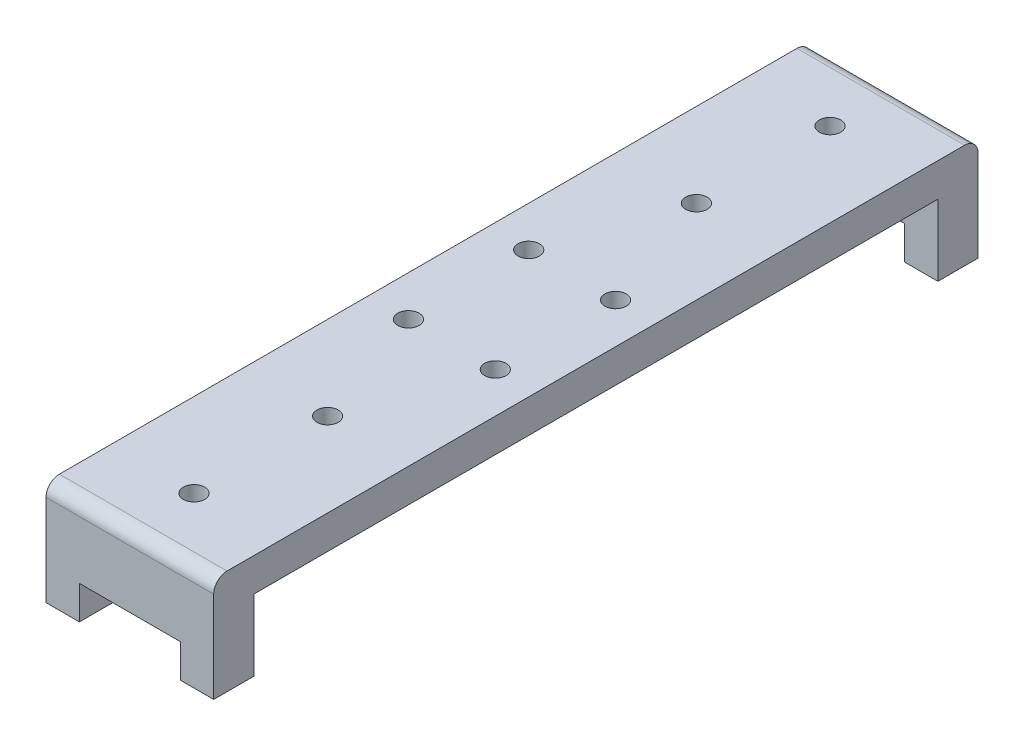
ISO-10303-21;
HEADER;
FILE_DESCRIPTION(('STEP AP214'),'2;1');
FILE_NAME('part.step','',(''),(''),'','','');
FILE_SCHEMA(('AUTOMOTIVE_DESIGN { 1 0 10303 214 1 1 1 1 }'));
ENDSEC;
DATA;
#1=APPLICATION_CONTEXT('core data for automotive mechanical design processes');
#2=APPLICATION_PROTOCOL_DEFINITION('international standard','automotive_design',2000,#1);
#3=PRODUCT_CONTEXT('',#1,'mechanical');
#4=PRODUCT('Part','Part','',(#3));
#5=PRODUCT_RELATED_PRODUCT_CATEGORY('part','',(#4));
#6=PRODUCT_DEFINITION_FORMATION('','',#4);
#7=PRODUCT_DEFINITION_CONTEXT('part definition',#1,'design');
#8=PRODUCT_DEFINITION('design','',#6,#7);
#9=PRODUCT_DEFINITION_SHAPE('','',#8);
#10=(LENGTH_UNIT() NAMED_UNIT(*) SI_UNIT(.MILLI.,.METRE.));
#11=(NAMED_UNIT(*) PLANE_ANGLE_UNIT() SI_UNIT($,.RADIAN.));
#12=(NAMED_UNIT(*) SI_UNIT($,.STERADIAN.) SOLID_ANGLE_UNIT());
#13=UNCERTAINTY_MEASURE_WITH_UNIT(LENGTH_MEASURE(1.E-05),#10,'distance_accuracy_value','');
#14=(GEOMETRIC_REPRESENTATION_CONTEXT(3) GLOBAL_UNCERTAINTY_ASSIGNED_CONTEXT((#13)) GLOBAL_UNIT_ASSIGNED_CONTEXT((#10,
#11,#12)) REPRESENTATION_CONTEXT('',''));
#15=CARTESIAN_POINT('',(0.,0.,0.));
#16=DIRECTION('',(0.,0.,1.));
#17=DIRECTION('',(1.,0.,0.));
#18=AXIS2_PLACEMENT_3D('',#15,#16,#17);
#19=CARTESIAN_POINT('',(0.,0.,0.));
#20=DIRECTION('',(0.,1.,0.));
#21=DIRECTION('',(0.,0.,1.));
#22=AXIS2_PLACEMENT_3D('',#19,#20,#21);
#23=PLANE('',#22);
#24=CARTESIAN_POINT('',(0.,0.,27.6));
#25=DIRECTION('',(0.,-1.,0.));
#26=DIRECTION('',(0.,0.,-1.));
#27=AXIS2_PLACEMENT_3D('',#24,#25,#26);
#28=CIRCLE('',#27,1.6);
#29=CARTESIAN_POINT('',(0.,0.,26.));
#30=VERTEX_POINT('',#29);
#31=EDGE_CURVE('E229',#30,#30,#28,.T.);
#32=ORIENTED_EDGE('',*,*,#31,.F.);
#33=EDGE_LOOP('',(#32));
#34=FACE_BOUND('',#33,.T.);
#35=CARTESIAN_POINT('',(-6.49999999999999,0.,9.));
#36=DIRECTION('',(0.,-1.,0.));
#37=DIRECTION('',(0.,0.,-1.));
#38=AXIS2_PLACEMENT_3D('',#35,#36,#37);
#39=CIRCLE('',#38,1.6);
#40=CARTESIAN_POINT('',(-6.49999999999999,0.,7.4));
#41=VERTEX_POINT('',#40);
#42=EDGE_CURVE('E244',#41,#41,#39,.T.);
#43=ORIENTED_EDGE('',*,*,#42,.F.);
#44=EDGE_LOOP('',(#43));
#45=FACE_BOUND('',#44,.T.);
#46=CARTESIAN_POINT('',(6.50000000000001,0.,9.));
#47=DIRECTION('',(0.,-1.,0.));
#48=DIRECTION('',(0.,0.,-1.));
#49=AXIS2_PLACEMENT_3D('',#46,#47,#48);
#50=CIRCLE('',#49,1.6);
#51=CARTESIAN_POINT('',(6.50000000000001,0.,7.4));
#52=VERTEX_POINT('',#51);
#53=EDGE_CURVE('E241',#52,#52,#50,.T.);
#54=ORIENTED_EDGE('',*,*,#53,.F.);
#55=EDGE_LOOP('',(#54));
#56=FACE_BOUND('',#55,.T.);
#57=CARTESIAN_POINT('',(0.,0.,47.6));
#58=DIRECTION('',(0.,-1.,0.));
#59=DIRECTION('',(0.,0.,-1.));
#60=AXIS2_PLACEMENT_3D('',#57,#58,#59);
#61=CIRCLE('',#60,1.6);
#62=CARTESIAN_POINT('',(0.,0.,46.));
#63=VERTEX_POINT('',#62);
#64=EDGE_CURVE('E215',#63,#63,#61,.T.);
#65=ORIENTED_EDGE('',*,*,#64,.F.);
#66=EDGE_LOOP('',(#65));
#67=FACE_BOUND('',#66,.T.);
#68=CARTESIAN_POINT('',(0.,0.,-47.6));
#69=DIRECTION('',(0.,1.,0.));
#70=DIRECTION('',(0.,0.,1.));
#71=AXIS2_PLACEMENT_3D('',#68,#69,#70);
#72=CIRCLE('',#71,1.6);
#73=CARTESIAN_POINT('',(0.,0.,-46.));
#74=VERTEX_POINT('',#73);
#75=EDGE_CURVE('E331',#74,#74,#72,.T.);
#76=ORIENTED_EDGE('',*,*,#75,.T.);
#77=EDGE_LOOP('',(#76));
#78=FACE_BOUND('',#77,.T.);
#79=CARTESIAN_POINT('',(6.50000000000001,0.,-9.));
#80=DIRECTION('',(0.,1.,0.));
#81=DIRECTION('',(0.,0.,1.));
#82=AXIS2_PLACEMENT_3D('',#79,#80,#81);
#83=CIRCLE('',#82,1.6);
#84=CARTESIAN_POINT('',(6.50000000000001,0.,-7.4));
#85=VERTEX_POINT('',#84);
#86=EDGE_CURVE('E334',#85,#85,#83,.T.);
#87=ORIENTED_EDGE('',*,*,#86,.T.);
#88=EDGE_LOOP('',(#87));
#89=FACE_BOUND('',#88,.T.);
#90=CARTESIAN_POINT('',(-6.49999999999999,0.,-9.));
#91=DIRECTION('',(0.,1.,0.));
#92=DIRECTION('',(0.,0.,1.));
#93=AXIS2_PLACEMENT_3D('',#90,#91,#92);
#94=CIRCLE('',#93,1.6);
#95=CARTESIAN_POINT('',(-6.49999999999999,0.,-7.4));
#96=VERTEX_POINT('',#95);
#97=EDGE_CURVE('E338',#96,#96,#94,.T.);
#98=ORIENTED_EDGE('',*,*,#97,.T.);
#99=EDGE_LOOP('',(#98));
#100=FACE_BOUND('',#99,.T.);
#101=CARTESIAN_POINT('',(0.,0.,-27.6));
#102=DIRECTION('',(0.,1.,0.));
#103=DIRECTION('',(0.,0.,1.));
#104=AXIS2_PLACEMENT_3D('',#101,#102,#103);
#105=CIRCLE('',#104,1.6);
#106=CARTESIAN_POINT('',(0.,0.,-26.));
#107=VERTEX_POINT('',#106);
#108=EDGE_CURVE('E341',#107,#107,#105,.T.);
#109=ORIENTED_EDGE('',*,*,#108,.T.);
#110=EDGE_LOOP('',(#109));
#111=FACE_BOUND('',#110,.T.);
#112=DIRECTION('',(-1.,0.,0.));
#113=VECTOR('',#112,1.);
#114=CARTESIAN_POINT('',(0.,0.,51.2));
#115=LINE('',#114,#113);
#116=CARTESIAN_POINT('',(12.55,0.,51.2));
#117=VERTEX_POINT('',#116);
#118=CARTESIAN_POINT('',(-12.55,0.,51.2));
#119=VERTEX_POINT('',#118);
#120=EDGE_CURVE('E196',#117,#119,#115,.T.);
#121=ORIENTED_EDGE('',*,*,#120,.T.);
#122=DIRECTION('',(0.,0.,1.));
#123=VECTOR('',#122,1.);
#124=CARTESIAN_POINT('',(-12.55,0.,0.));
#125=LINE('',#124,#123);
#126=CARTESIAN_POINT('',(-12.55,0.,-51.2));
#127=VERTEX_POINT('',#126);
#128=EDGE_CURVE('E272',#127,#119,#125,.T.);
#129=ORIENTED_EDGE('',*,*,#128,.F.);
#130=DIRECTION('',(-1.,0.,0.));
#131=VECTOR('',#130,1.);
#132=CARTESIAN_POINT('',(0.,0.,-51.2));
#133=LINE('',#132,#131);
#134=CARTESIAN_POINT('',(12.55,0.,-51.2));
#135=VERTEX_POINT('',#134);
#136=EDGE_CURVE('E267',#135,#127,#133,.T.);
#137=ORIENTED_EDGE('',*,*,#136,.F.);
#138=DIRECTION('',(0.,0.,1.));
#139=VECTOR('',#138,1.);
#140=CARTESIAN_POINT('',(12.55,0.,0.));
#141=LINE('',#140,#139);
#142=EDGE_CURVE('E344',#135,#117,#141,.T.);
#143=ORIENTED_EDGE('',*,*,#142,.T.);
#144=EDGE_LOOP('',(#121,#129,#137,#143));
#145=FACE_BOUND('',#144,.T.);
#146=ADVANCED_FACE('F35',(#34,#45,#56,#67,#78,#89,#100,#111,#145),#23,.F.);
#147=CARTESIAN_POINT('',(12.55,5.,0.));
#148=DIRECTION('',(1.,0.,0.));
#149=DIRECTION('',(0.,0.,-1.));
#150=AXIS2_PLACEMENT_3D('',#147,#148,#149);
#151=PLANE('',#150);
#152=DIRECTION('',(0.,-1.,0.));
#153=VECTOR('',#152,1.);
#154=CARTESIAN_POINT('',(12.55,5.,-57.2));
#155=LINE('',#154,#153);
#156=CARTESIAN_POINT('',(12.55,3.,-57.2));
#157=VERTEX_POINT('',#156);
#158=CARTESIAN_POINT('',(12.55,-10.65,-57.2));
#159=VERTEX_POINT('',#158);
#160=EDGE_CURVE('E286',#157,#159,#155,.T.);
#161=ORIENTED_EDGE('',*,*,#160,.F.);
#162=CARTESIAN_POINT('',(12.55,3.,-55.2));
#163=DIRECTION('',(1.,0.,0.));
#164=DIRECTION('',(0.,0.,-1.));
#165=AXIS2_PLACEMENT_3D('',#162,#163,#164);
#166=CIRCLE('',#165,2.);
#167=CARTESIAN_POINT('',(12.55,5.,-55.2));
#168=VERTEX_POINT('',#167);
#169=EDGE_CURVE('E288',#157,#168,#166,.T.);
#170=ORIENTED_EDGE('',*,*,#169,.T.);
#171=DIRECTION('',(0.,0.,1.));
#172=VECTOR('',#171,1.);
#173=CARTESIAN_POINT('',(12.55,5.,0.));
#174=LINE('',#173,#172);
#175=CARTESIAN_POINT('',(12.55,5.,55.2));
#176=VERTEX_POINT('',#175);
#177=EDGE_CURVE('E317',#168,#176,#174,.T.);
#178=ORIENTED_EDGE('',*,*,#177,.T.);
#179=CARTESIAN_POINT('',(12.55,3.,55.2));
#180=DIRECTION('',(1.,0.,0.));
#181=DIRECTION('',(0.,0.,-1.));
#182=AXIS2_PLACEMENT_3D('',#179,#180,#181);
#183=CIRCLE('',#182,2.);
#184=CARTESIAN_POINT('',(12.55,3.,57.2));
#185=VERTEX_POINT('',#184);
#186=EDGE_CURVE('E285',#176,#185,#183,.T.);
#187=ORIENTED_EDGE('',*,*,#186,.T.);
#188=DIRECTION('',(0.,-1.,0.));
#189=VECTOR('',#188,1.);
#190=CARTESIAN_POINT('',(12.55,5.,57.2));
#191=LINE('',#190,#189);
#192=CARTESIAN_POINT('',(12.55,-10.65,57.2));
#193=VERTEX_POINT('',#192);
#194=EDGE_CURVE('E238',#185,#193,#191,.T.);
#195=ORIENTED_EDGE('',*,*,#194,.T.);
#196=DIRECTION('',(0.,0.,1.));
#197=VECTOR('',#196,1.);
#198=CARTESIAN_POINT('',(12.55,-10.65,51.2));
#199=LINE('',#198,#197);
#200=CARTESIAN_POINT('',(12.55,-10.65,51.2));
#201=VERTEX_POINT('',#200);
#202=EDGE_CURVE('E221',#201,#193,#199,.T.);
#203=ORIENTED_EDGE('',*,*,#202,.F.);
#204=DIRECTION('',(0.,1.,0.));
#205=VECTOR('',#204,1.);
#206=CARTESIAN_POINT('',(12.55,0.,51.2));
#207=LINE('',#206,#205);
#208=EDGE_CURVE('E193',#201,#117,#207,.T.);
#209=ORIENTED_EDGE('',*,*,#208,.T.);
#210=ORIENTED_EDGE('',*,*,#142,.F.);
#211=DIRECTION('',(0.,1.,0.));
#212=VECTOR('',#211,1.);
#213=CARTESIAN_POINT('',(12.55,0.,-51.2));
#214=LINE('',#213,#212);
#215=CARTESIAN_POINT('',(12.55,-10.65,-51.2));
#216=VERTEX_POINT('',#215);
#217=EDGE_CURVE('E271',#216,#135,#214,.T.);
#218=ORIENTED_EDGE('',*,*,#217,.F.);
#219=DIRECTION('',(0.,0.,-1.));
#220=VECTOR('',#219,1.);
#221=CARTESIAN_POINT('',(12.55,-10.65,-51.2));
#222=LINE('',#221,#220);
#223=EDGE_CURVE('E357',#216,#159,#222,.T.);
#224=ORIENTED_EDGE('',*,*,#223,.T.);
#225=EDGE_LOOP('',(#161,#170,#178,#187,#195,#203,#209,#210,#218,#224));
#226=FACE_BOUND('',#225,.T.);
#227=ADVANCED_FACE('F316',(#226),#151,.T.);
#228=CARTESIAN_POINT('',(0.,5.,-57.2));
#229=DIRECTION('',(0.,0.,-1.));
#230=DIRECTION('',(-1.,0.,0.));
#231=AXIS2_PLACEMENT_3D('',#228,#229,#230);
#232=PLANE('',#231);
#233=DIRECTION('',(0.,-1.,0.));
#234=VECTOR('',#233,1.);
#235=CARTESIAN_POINT('',(-12.55,5.,-57.2));
#236=LINE('',#235,#234);
#237=CARTESIAN_POINT('',(-12.55,3.,-57.2));
#238=VERTEX_POINT('',#237);
#239=CARTESIAN_POINT('',(-12.55,-10.65,-57.2));
#240=VERTEX_POINT('',#239);
#241=EDGE_CURVE('E299',#238,#240,#236,.T.);
#242=ORIENTED_EDGE('',*,*,#241,.F.);
#243=DIRECTION('',(1.,0.,0.));
#244=VECTOR('',#243,1.);
#245=CARTESIAN_POINT('',(0.,3.,-57.2));
#246=LINE('',#245,#244);
#247=EDGE_CURVE('E282',#238,#157,#246,.T.);
#248=ORIENTED_EDGE('',*,*,#247,.T.);
#249=ORIENTED_EDGE('',*,*,#160,.T.);
#250=DIRECTION('',(1.,0.,0.));
#251=VECTOR('',#250,1.);
#252=CARTESIAN_POINT('',(0.,-10.65,-57.2));
#253=LINE('',#252,#251);
#254=CARTESIAN_POINT('',(7.55,-10.65,-57.2));
#255=VERTEX_POINT('',#254);
#256=EDGE_CURVE('E351',#255,#159,#253,.T.);
#257=ORIENTED_EDGE('',*,*,#256,.F.);
#258=DIRECTION('',(0.,-1.,0.));
#259=VECTOR('',#258,1.);
#260=CARTESIAN_POINT('',(7.55,0.,-57.2));
#261=LINE('',#260,#259);
#262=CARTESIAN_POINT('',(7.55,-5.65,-57.2));
#263=VERTEX_POINT('',#262);
#264=EDGE_CURVE('E257',#263,#255,#261,.T.);
#265=ORIENTED_EDGE('',*,*,#264,.F.);
#266=DIRECTION('',(1.,0.,0.));
#267=VECTOR('',#266,1.);
#268=CARTESIAN_POINT('',(0.,-5.65,-57.2));
#269=LINE('',#268,#267);
#270=CARTESIAN_POINT('',(-7.55,-5.65,-57.2));
#271=VERTEX_POINT('',#270);
#272=EDGE_CURVE('E252',#271,#263,#269,.T.);
#273=ORIENTED_EDGE('',*,*,#272,.F.);
#274=DIRECTION('',(0.,1.,0.));
#275=VECTOR('',#274,1.);
#276=CARTESIAN_POINT('',(-7.55,0.,-57.2));
#277=LINE('',#276,#275);
#278=CARTESIAN_POINT('',(-7.55,-10.65,-57.2));
#279=VERTEX_POINT('',#278);
#280=EDGE_CURVE('E738',#279,#271,#277,.T.);
#281=ORIENTED_EDGE('',*,*,#280,.F.);
#282=DIRECTION('',(1.,0.,0.));
#283=VECTOR('',#282,1.);
#284=CARTESIAN_POINT('',(0.,-10.65,-57.2));
#285=LINE('',#284,#283);
#286=EDGE_CURVE('E310',#240,#279,#285,.T.);
#287=ORIENTED_EDGE('',*,*,#286,.F.);
#288=EDGE_LOOP('',(#242,#248,#249,#257,#265,#273,#281,#287));
#289=FACE_BOUND('',#288,.T.);
#290=ADVANCED_FACE('F307',(#289),#232,.T.);
#291=CARTESIAN_POINT('',(-12.55,5.,0.));
#292=DIRECTION('',(1.,0.,0.));
#293=DIRECTION('',(0.,0.,-1.));
#294=AXIS2_PLACEMENT_3D('',#291,#292,#293);
#295=PLANE('',#294);
#296=DIRECTION('',(0.,0.,1.));
#297=VECTOR('',#296,1.);
#298=CARTESIAN_POINT('',(-12.55,5.,0.));
#299=LINE('',#298,#297);
#300=CARTESIAN_POINT('',(-12.55,5.,-55.2));
#301=VERTEX_POINT('',#300);
#302=CARTESIAN_POINT('',(-12.55,5.,55.2));
#303=VERTEX_POINT('',#302);
#304=EDGE_CURVE('E301',#301,#303,#299,.T.);
#305=ORIENTED_EDGE('',*,*,#304,.F.);
#306=CARTESIAN_POINT('',(-12.55,3.,-55.2));
#307=DIRECTION('',(1.,0.,0.));
#308=DIRECTION('',(0.,0.,-1.));
#309=AXIS2_PLACEMENT_3D('',#306,#307,#308);
#310=CIRCLE('',#309,2.);
#311=EDGE_CURVE('E43',#301,#238,#310,.F.);
#312=ORIENTED_EDGE('',*,*,#311,.T.);
#313=ORIENTED_EDGE('',*,*,#241,.T.);
#314=DIRECTION('',(0.,0.,-1.));
#315=VECTOR('',#314,1.);
#316=CARTESIAN_POINT('',(-12.55,-10.65,-51.2));
#317=LINE('',#316,#315);
#318=CARTESIAN_POINT('',(-12.55,-10.65,-51.2));
#319=VERTEX_POINT('',#318);
#320=EDGE_CURVE('E363',#319,#240,#317,.T.);
#321=ORIENTED_EDGE('',*,*,#320,.F.);
#322=DIRECTION('',(0.,-1.,0.));
#323=VECTOR('',#322,1.);
#324=CARTESIAN_POINT('',(-12.55,0.,-51.2));
#325=LINE('',#324,#323);
#326=EDGE_CURVE('E261',#127,#319,#325,.T.);
#327=ORIENTED_EDGE('',*,*,#326,.F.);
#328=ORIENTED_EDGE('',*,*,#128,.T.);
#329=DIRECTION('',(0.,-1.,0.));
#330=VECTOR('',#329,1.);
#331=CARTESIAN_POINT('',(-12.55,0.,51.2));
#332=LINE('',#331,#330);
#333=CARTESIAN_POINT('',(-12.55,-10.65,51.2));
#334=VERTEX_POINT('',#333);
#335=EDGE_CURVE('E199',#119,#334,#332,.T.);
#336=ORIENTED_EDGE('',*,*,#335,.T.);
#337=DIRECTION('',(0.,0.,1.));
#338=VECTOR('',#337,1.);
#339=CARTESIAN_POINT('',(-12.55,-10.65,51.2));
#340=LINE('',#339,#338);
#341=CARTESIAN_POINT('',(-12.55,-10.65,57.2));
#342=VERTEX_POINT('',#341);
#343=EDGE_CURVE('E218',#334,#342,#340,.T.);
#344=ORIENTED_EDGE('',*,*,#343,.T.);
#345=DIRECTION('',(0.,-1.,0.));
#346=VECTOR('',#345,1.);
#347=CARTESIAN_POINT('',(-12.55,5.,57.2));
#348=LINE('',#347,#346);
#349=CARTESIAN_POINT('',(-12.55,3.,57.2));
#350=VERTEX_POINT('',#349);
#351=EDGE_CURVE('E250',#350,#342,#348,.T.);
#352=ORIENTED_EDGE('',*,*,#351,.F.);
#353=CARTESIAN_POINT('',(-12.55,3.,55.2));
#354=DIRECTION('',(1.,0.,0.));
#355=DIRECTION('',(0.,0.,-1.));
#356=AXIS2_PLACEMENT_3D('',#353,#354,#355);
#357=CIRCLE('',#356,2.);
#358=EDGE_CURVE('E55',#350,#303,#357,.F.);
#359=ORIENTED_EDGE('',*,*,#358,.T.);
#360=EDGE_LOOP('',(#305,#312,#313,#321,#327,#328,#336,#344,#352,#359));
#361=FACE_BOUND('',#360,.T.);
#362=ADVANCED_FACE('F297',(#361),#295,.F.);
#363=CARTESIAN_POINT('',(0.,5.,-27.6));
#364=DIRECTION('',(0.,-1.,0.));
#365=DIRECTION('',(0.,0.,-1.));
#366=AXIS2_PLACEMENT_3D('',#363,#364,#365);
#367=CYLINDRICAL_SURFACE('',#366,1.6);
#368=CARTESIAN_POINT('',(0.,5.,-27.6));
#369=DIRECTION('',(0.,1.,0.));
#370=DIRECTION('',(0.,0.,1.));
#371=AXIS2_PLACEMENT_3D('',#368,#369,#370);
#372=CIRCLE('',#371,1.6);
#373=CARTESIAN_POINT('',(0.,5.,-26.));
#374=VERTEX_POINT('',#373);
#375=EDGE_CURVE('E323',#374,#374,#372,.T.);
#376=ORIENTED_EDGE('',*,*,#375,.T.);
#377=EDGE_LOOP('',(#376));
#378=FACE_BOUND('',#377,.T.);
#379=ORIENTED_EDGE('',*,*,#108,.F.);
#380=EDGE_LOOP('',(#379));
#381=FACE_BOUND('',#380,.T.);
#382=ADVANCED_FACE('F395',(#378,#381),#367,.F.);
#383=CARTESIAN_POINT('',(-6.49999999999999,5.,-9.));
#384=DIRECTION('',(0.,-1.,0.));
#385=DIRECTION('',(0.,0.,-1.));
#386=AXIS2_PLACEMENT_3D('',#383,#384,#385);
#387=CYLINDRICAL_SURFACE('',#386,1.6);
#388=CARTESIAN_POINT('',(-6.49999999999999,5.,-9.));
#389=DIRECTION('',(0.,1.,0.));
#390=DIRECTION('',(0.,0.,1.));
#391=AXIS2_PLACEMENT_3D('',#388,#389,#390);
#392=CIRCLE('',#391,1.6);
#393=CARTESIAN_POINT('',(-6.49999999999999,5.,-7.4));
#394=VERTEX_POINT('',#393);
#395=EDGE_CURVE('E327',#394,#394,#392,.T.);
#396=ORIENTED_EDGE('',*,*,#395,.T.);
#397=EDGE_LOOP('',(#396));
#398=FACE_BOUND('',#397,.T.);
#399=ORIENTED_EDGE('',*,*,#97,.F.);
#400=EDGE_LOOP('',(#399));
#401=FACE_BOUND('',#400,.T.);
#402=ADVANCED_FACE('F384',(#398,#401),#387,.F.);
#403=CARTESIAN_POINT('',(6.50000000000001,5.,-9.));
#404=DIRECTION('',(0.,-1.,0.));
#405=DIRECTION('',(0.,0.,-1.));
#406=AXIS2_PLACEMENT_3D('',#403,#404,#405);
#407=CYLINDRICAL_SURFACE('',#406,1.6);
#408=CARTESIAN_POINT('',(6.50000000000001,5.,-9.));
#409=DIRECTION('',(0.,1.,0.));
#410=DIRECTION('',(0.,0.,1.));
#411=AXIS2_PLACEMENT_3D('',#408,#409,#410);
#412=CIRCLE('',#411,1.6);
#413=CARTESIAN_POINT('',(6.50000000000001,5.,-7.4));
#414=VERTEX_POINT('',#413);
#415=EDGE_CURVE('E379',#414,#414,#412,.T.);
#416=ORIENTED_EDGE('',*,*,#415,.T.);
#417=EDGE_LOOP('',(#416));
#418=FACE_BOUND('',#417,.T.);
#419=ORIENTED_EDGE('',*,*,#86,.F.);
#420=EDGE_LOOP('',(#419));
#421=FACE_BOUND('',#420,.T.);
#422=ADVANCED_FACE('F434',(#418,#421),#407,.F.);
#423=CARTESIAN_POINT('',(0.,5.,-47.6));
#424=DIRECTION('',(0.,-1.,0.));
#425=DIRECTION('',(0.,0.,-1.));
#426=AXIS2_PLACEMENT_3D('',#423,#424,#425);
#427=CYLINDRICAL_SURFACE('',#426,1.6);
#428=CARTESIAN_POINT('',(0.,5.,-47.6));
#429=DIRECTION('',(0.,1.,0.));
#430=DIRECTION('',(0.,0.,1.));
#431=AXIS2_PLACEMENT_3D('',#428,#429,#430);
#432=CIRCLE('',#431,1.6);
#433=CARTESIAN_POINT('',(0.,5.,-46.));
#434=VERTEX_POINT('',#433);
#435=EDGE_CURVE('E376',#434,#434,#432,.T.);
#436=ORIENTED_EDGE('',*,*,#435,.T.);
#437=EDGE_LOOP('',(#436));
#438=FACE_BOUND('',#437,.T.);
#439=ORIENTED_EDGE('',*,*,#75,.F.);
#440=EDGE_LOOP('',(#439));
#441=FACE_BOUND('',#440,.T.);
#442=ADVANCED_FACE('F390',(#438,#441),#427,.F.);
#443=CARTESIAN_POINT('',(0.,5.,0.));
#444=DIRECTION('',(0.,1.,0.));
#445=DIRECTION('',(0.,0.,1.));
#446=AXIS2_PLACEMENT_3D('',#443,#444,#445);
#447=PLANE('',#446);
#448=ORIENTED_EDGE('',*,*,#435,.F.);
#449=EDGE_LOOP('',(#448));
#450=FACE_BOUND('',#449,.T.);
#451=ORIENTED_EDGE('',*,*,#415,.F.);
#452=EDGE_LOOP('',(#451));
#453=FACE_BOUND('',#452,.T.);
#454=ORIENTED_EDGE('',*,*,#395,.F.);
#455=EDGE_LOOP('',(#454));
#456=FACE_BOUND('',#455,.T.);
#457=ORIENTED_EDGE('',*,*,#375,.F.);
#458=EDGE_LOOP('',(#457));
#459=FACE_BOUND('',#458,.T.);
#460=ORIENTED_EDGE('',*,*,#177,.F.);
#461=DIRECTION('',(1.,0.,0.));
#462=VECTOR('',#461,1.);
#463=CARTESIAN_POINT('',(0.,5.,-55.2));
#464=LINE('',#463,#462);
#465=EDGE_CURVE('E293',#168,#301,#464,.F.);
#466=ORIENTED_EDGE('',*,*,#465,.T.);
#467=ORIENTED_EDGE('',*,*,#304,.T.);
#468=DIRECTION('',(1.,0.,0.));
#469=VECTOR('',#468,1.);
#470=CARTESIAN_POINT('',(12.55,5.,55.2));
#471=LINE('',#470,#469);
#472=EDGE_CURVE('E290',#303,#176,#471,.T.);
#473=ORIENTED_EDGE('',*,*,#472,.T.);
#474=EDGE_LOOP('',(#460,#466,#467,#473));
#475=FACE_BOUND('',#474,.T.);
#476=CARTESIAN_POINT('',(0.,5.,47.6));
#477=DIRECTION('',(0.,-1.,0.));
#478=DIRECTION('',(0.,0.,-1.));
#479=AXIS2_PLACEMENT_3D('',#476,#477,#478);
#480=CIRCLE('',#479,1.6);
#481=CARTESIAN_POINT('',(0.,5.,46.));
#482=VERTEX_POINT('',#481);
#483=EDGE_CURVE('E225',#482,#482,#480,.T.);
#484=ORIENTED_EDGE('',*,*,#483,.T.);
#485=EDGE_LOOP('',(#484));
#486=FACE_BOUND('',#485,.T.);
#487=CARTESIAN_POINT('',(6.50000000000001,5.,9.));
#488=DIRECTION('',(0.,-1.,0.));
#489=DIRECTION('',(0.,0.,-1.));
#490=AXIS2_PLACEMENT_3D('',#487,#488,#489);
#491=CIRCLE('',#490,1.6);
#492=CARTESIAN_POINT('',(6.50000000000001,5.,7.4));
#493=VERTEX_POINT('',#492);
#494=EDGE_CURVE('E228',#493,#493,#491,.T.);
#495=ORIENTED_EDGE('',*,*,#494,.T.);
#496=EDGE_LOOP('',(#495));
#497=FACE_BOUND('',#496,.T.);
#498=CARTESIAN_POINT('',(-6.49999999999999,5.,9.));
#499=DIRECTION('',(0.,-1.,0.));
#500=DIRECTION('',(0.,0.,-1.));
#501=AXIS2_PLACEMENT_3D('',#498,#499,#500);
#502=CIRCLE('',#501,1.6);
#503=CARTESIAN_POINT('',(-6.49999999999999,5.,7.4));
#504=VERTEX_POINT('',#503);
#505=EDGE_CURVE('E232',#504,#504,#502,.T.);
#506=ORIENTED_EDGE('',*,*,#505,.T.);
#507=EDGE_LOOP('',(#506));
#508=FACE_BOUND('',#507,.T.);
#509=CARTESIAN_POINT('',(0.,5.,27.6));
#510=DIRECTION('',(0.,-1.,0.));
#511=DIRECTION('',(0.,0.,-1.));
#512=AXIS2_PLACEMENT_3D('',#509,#510,#511);
#513=CIRCLE('',#512,1.6);
#514=CARTESIAN_POINT('',(0.,5.,26.));
#515=VERTEX_POINT('',#514);
#516=EDGE_CURVE('E235',#515,#515,#513,.T.);
#517=ORIENTED_EDGE('',*,*,#516,.T.);
#518=EDGE_LOOP('',(#517));
#519=FACE_BOUND('',#518,.T.);
#520=ADVANCED_FACE('F320',(#450,#453,#456,#459,#475,#486,#497,#508,#519),#447,.T.);
#521=CARTESIAN_POINT('',(0.,-5.65,-51.2));
#522=DIRECTION('',(0.,1.,0.));
#523=DIRECTION('',(-1.,0.,0.));
#524=AXIS2_PLACEMENT_3D('',#521,#522,#523);
#525=PLANE('',#524);
#526=ORIENTED_EDGE('',*,*,#272,.T.);
#527=DIRECTION('',(0.,0.,-1.));
#528=VECTOR('',#527,1.);
#529=CARTESIAN_POINT('',(7.55,-5.65,-51.2));
#530=LINE('',#529,#528);
#531=CARTESIAN_POINT('',(7.55,-5.65,-51.2));
#532=VERTEX_POINT('',#531);
#533=EDGE_CURVE('E335',#532,#263,#530,.T.);
#534=ORIENTED_EDGE('',*,*,#533,.F.);
#535=DIRECTION('',(1.,0.,0.));
#536=VECTOR('',#535,1.);
#537=CARTESIAN_POINT('',(0.,-5.65,-51.2));
#538=LINE('',#537,#536);
#539=CARTESIAN_POINT('',(-7.55,-5.65,-51.2));
#540=VERTEX_POINT('',#539);
#541=EDGE_CURVE('E253',#540,#532,#538,.T.);
#542=ORIENTED_EDGE('',*,*,#541,.F.);
#543=DIRECTION('',(0.,0.,-1.));
#544=VECTOR('',#543,1.);
#545=CARTESIAN_POINT('',(-7.55,-5.65,-51.2));
#546=LINE('',#545,#544);
#547=EDGE_CURVE('E372',#540,#271,#546,.T.);
#548=ORIENTED_EDGE('',*,*,#547,.T.);
#549=EDGE_LOOP('',(#526,#534,#542,#548));
#550=FACE_BOUND('',#549,.T.);
#551=ADVANCED_FACE('F389',(#550),#525,.F.);
#552=CARTESIAN_POINT('',(7.55,0.,-51.2));
#553=DIRECTION('',(1.,0.,0.));
#554=DIRECTION('',(0.,0.,-1.));
#555=AXIS2_PLACEMENT_3D('',#552,#553,#554);
#556=PLANE('',#555);
#557=ORIENTED_EDGE('',*,*,#264,.T.);
#558=DIRECTION('',(0.,0.,-1.));
#559=VECTOR('',#558,1.);
#560=CARTESIAN_POINT('',(7.55,-10.65,-51.2));
#561=LINE('',#560,#559);
#562=CARTESIAN_POINT('',(7.55,-10.65,-51.2));
#563=VERTEX_POINT('',#562);
#564=EDGE_CURVE('E360',#563,#255,#561,.T.);
#565=ORIENTED_EDGE('',*,*,#564,.F.);
#566=DIRECTION('',(0.,-1.,0.));
#567=VECTOR('',#566,1.);
#568=CARTESIAN_POINT('',(7.55,0.,-51.2));
#569=LINE('',#568,#567);
#570=EDGE_CURVE('E375',#532,#563,#569,.T.);
#571=ORIENTED_EDGE('',*,*,#570,.F.);
#572=ORIENTED_EDGE('',*,*,#533,.T.);
#573=EDGE_LOOP('',(#557,#565,#571,#572));
#574=FACE_BOUND('',#573,.T.);
#575=ADVANCED_FACE('F449',(#574),#556,.F.);
#576=CARTESIAN_POINT('',(0.,-10.65,-51.2));
#577=DIRECTION('',(0.,1.,0.));
#578=DIRECTION('',(-1.,0.,0.));
#579=AXIS2_PLACEMENT_3D('',#576,#577,#578);
#580=PLANE('',#579);
#581=ORIENTED_EDGE('',*,*,#256,.T.);
#582=ORIENTED_EDGE('',*,*,#223,.F.);
#583=DIRECTION('',(1.,0.,0.));
#584=VECTOR('',#583,1.);
#585=CARTESIAN_POINT('',(0.,-10.65,-51.2));
#586=LINE('',#585,#584);
#587=EDGE_CURVE('E264',#563,#216,#586,.T.);
#588=ORIENTED_EDGE('',*,*,#587,.F.);
#589=ORIENTED_EDGE('',*,*,#564,.T.);
#590=EDGE_LOOP('',(#581,#582,#588,#589));
#591=FACE_BOUND('',#590,.T.);
#592=ADVANCED_FACE('F355',(#591),#580,.F.);
#593=CARTESIAN_POINT('',(0.,-10.65,-51.2));
#594=DIRECTION('',(0.,1.,0.));
#595=DIRECTION('',(0.,0.,1.));
#596=AXIS2_PLACEMENT_3D('',#593,#594,#595);
#597=PLANE('',#596);
#598=ORIENTED_EDGE('',*,*,#286,.T.);
#599=DIRECTION('',(0.,0.,-1.));
#600=VECTOR('',#599,1.);
#601=CARTESIAN_POINT('',(-7.55,-10.65,-51.2));
#602=LINE('',#601,#600);
#603=CARTESIAN_POINT('',(-7.55,-10.65,-51.2));
#604=VERTEX_POINT('',#603);
#605=EDGE_CURVE('E366',#604,#279,#602,.T.);
#606=ORIENTED_EDGE('',*,*,#605,.F.);
#607=DIRECTION('',(1.,0.,0.));
#608=VECTOR('',#607,1.);
#609=CARTESIAN_POINT('',(0.,-10.65,-51.2));
#610=LINE('',#609,#608);
#611=EDGE_CURVE('E259',#319,#604,#610,.T.);
#612=ORIENTED_EDGE('',*,*,#611,.F.);
#613=ORIENTED_EDGE('',*,*,#320,.T.);
#614=EDGE_LOOP('',(#598,#606,#612,#613));
#615=FACE_BOUND('',#614,.T.);
#616=ADVANCED_FACE('F454',(#615),#597,.F.);
#617=CARTESIAN_POINT('',(-7.55,0.,-51.2));
#618=DIRECTION('',(-1.,0.,0.));
#619=DIRECTION('',(0.,-1.,0.));
#620=AXIS2_PLACEMENT_3D('',#617,#618,#619);
#621=PLANE('',#620);
#622=ORIENTED_EDGE('',*,*,#280,.T.);
#623=ORIENTED_EDGE('',*,*,#547,.F.);
#624=DIRECTION('',(0.,1.,0.));
#625=VECTOR('',#624,1.);
#626=CARTESIAN_POINT('',(-7.55,0.,-51.2));
#627=LINE('',#626,#625);
#628=EDGE_CURVE('E256',#604,#540,#627,.T.);
#629=ORIENTED_EDGE('',*,*,#628,.F.);
#630=ORIENTED_EDGE('',*,*,#605,.T.);
#631=EDGE_LOOP('',(#622,#623,#629,#630));
#632=FACE_BOUND('',#631,.T.);
#633=ADVANCED_FACE('F451',(#632),#621,.F.);
#634=CARTESIAN_POINT('',(0.,0.,-51.2));
#635=DIRECTION('',(0.,0.,-1.));
#636=DIRECTION('',(-1.,0.,0.));
#637=AXIS2_PLACEMENT_3D('',#634,#635,#636);
#638=PLANE('',#637);
#639=ORIENTED_EDGE('',*,*,#541,.T.);
#640=ORIENTED_EDGE('',*,*,#570,.T.);
#641=ORIENTED_EDGE('',*,*,#587,.T.);
#642=ORIENTED_EDGE('',*,*,#217,.T.);
#643=ORIENTED_EDGE('',*,*,#136,.T.);
#644=ORIENTED_EDGE('',*,*,#326,.T.);
#645=ORIENTED_EDGE('',*,*,#611,.T.);
#646=ORIENTED_EDGE('',*,*,#628,.T.);
#647=EDGE_LOOP('',(#639,#640,#641,#642,#643,#644,#645,#646));
#648=FACE_BOUND('',#647,.T.);
#649=ADVANCED_FACE('F409',(#648),#638,.F.);
#650=CARTESIAN_POINT('',(0.,5.,27.6));
#651=DIRECTION('',(0.,-1.,0.));
#652=DIRECTION('',(0.,0.,-1.));
#653=AXIS2_PLACEMENT_3D('',#650,#651,#652);
#654=CYLINDRICAL_SURFACE('',#653,1.6);
#655=ORIENTED_EDGE('',*,*,#516,.F.);
#656=EDGE_LOOP('',(#655));
#657=FACE_BOUND('',#656,.T.);
#658=ORIENTED_EDGE('',*,*,#31,.T.);
#659=EDGE_LOOP('',(#658));
#660=FACE_BOUND('',#659,.T.);
#661=ADVANCED_FACE('F466',(#657,#660),#654,.F.);
#662=CARTESIAN_POINT('',(-6.49999999999999,5.,9.));
#663=DIRECTION('',(0.,-1.,0.));
#664=DIRECTION('',(0.,0.,-1.));
#665=AXIS2_PLACEMENT_3D('',#662,#663,#664);
#666=CYLINDRICAL_SURFACE('',#665,1.6);
#667=ORIENTED_EDGE('',*,*,#505,.F.);
#668=EDGE_LOOP('',(#667));
#669=FACE_BOUND('',#668,.T.);
#670=ORIENTED_EDGE('',*,*,#42,.T.);
#671=EDGE_LOOP('',(#670));
#672=FACE_BOUND('',#671,.T.);
#673=ADVANCED_FACE('F474',(#669,#672),#666,.F.);
#674=CARTESIAN_POINT('',(6.50000000000001,5.,9.));
#675=DIRECTION('',(0.,-1.,0.));
#676=DIRECTION('',(0.,0.,-1.));
#677=AXIS2_PLACEMENT_3D('',#674,#675,#676);
#678=CYLINDRICAL_SURFACE('',#677,1.6);
#679=ORIENTED_EDGE('',*,*,#494,.F.);
#680=EDGE_LOOP('',(#679));
#681=FACE_BOUND('',#680,.T.);
#682=ORIENTED_EDGE('',*,*,#53,.T.);
#683=EDGE_LOOP('',(#682));
#684=FACE_BOUND('',#683,.T.);
#685=ADVANCED_FACE('F470',(#681,#684),#678,.F.);
#686=CARTESIAN_POINT('',(0.,5.,47.6));
#687=DIRECTION('',(0.,-1.,0.));
#688=DIRECTION('',(0.,0.,-1.));
#689=AXIS2_PLACEMENT_3D('',#686,#687,#688);
#690=CYLINDRICAL_SURFACE('',#689,1.6);
#691=ORIENTED_EDGE('',*,*,#483,.F.);
#692=EDGE_LOOP('',(#691));
#693=FACE_BOUND('',#692,.T.);
#694=ORIENTED_EDGE('',*,*,#64,.T.);
#695=EDGE_LOOP('',(#694));
#696=FACE_BOUND('',#695,.T.);
#697=ADVANCED_FACE('F467',(#693,#696),#690,.F.);
#698=CARTESIAN_POINT('',(0.,5.,57.2));
#699=DIRECTION('',(0.,0.,-1.));
#700=DIRECTION('',(-1.,0.,0.));
#701=AXIS2_PLACEMENT_3D('',#698,#699,#700);
#702=PLANE('',#701);
#703=ORIENTED_EDGE('',*,*,#194,.F.);
#704=DIRECTION('',(1.,0.,0.));
#705=VECTOR('',#704,1.);
#706=CARTESIAN_POINT('',(-12.55,3.,57.2));
#707=LINE('',#706,#705);
#708=EDGE_CURVE('E11',#185,#350,#707,.F.);
#709=ORIENTED_EDGE('',*,*,#708,.T.);
#710=ORIENTED_EDGE('',*,*,#351,.T.);
#711=DIRECTION('',(1.,0.,0.));
#712=VECTOR('',#711,1.);
#713=CARTESIAN_POINT('',(0.,-10.65,57.2));
#714=LINE('',#713,#712);
#715=CARTESIAN_POINT('',(-7.55,-10.65,57.2));
#716=VERTEX_POINT('',#715);
#717=EDGE_CURVE('E189',#342,#716,#714,.T.);
#718=ORIENTED_EDGE('',*,*,#717,.T.);
#719=DIRECTION('',(0.,1.,0.));
#720=VECTOR('',#719,1.);
#721=CARTESIAN_POINT('',(-7.55,0.,57.2));
#722=LINE('',#721,#720);
#723=CARTESIAN_POINT('',(-7.55,-5.65,57.2));
#724=VERTEX_POINT('',#723);
#725=EDGE_CURVE('E186',#716,#724,#722,.T.);
#726=ORIENTED_EDGE('',*,*,#725,.T.);
#727=DIRECTION('',(1.,0.,0.));
#728=VECTOR('',#727,1.);
#729=CARTESIAN_POINT('',(0.,-5.65,57.2));
#730=LINE('',#729,#728);
#731=CARTESIAN_POINT('',(7.55,-5.65,57.2));
#732=VERTEX_POINT('',#731);
#733=EDGE_CURVE('E206',#724,#732,#730,.T.);
#734=ORIENTED_EDGE('',*,*,#733,.T.);
#735=DIRECTION('',(0.,-1.,0.));
#736=VECTOR('',#735,1.);
#737=CARTESIAN_POINT('',(7.55,0.,57.2));
#738=LINE('',#737,#736);
#739=CARTESIAN_POINT('',(7.55,-10.65,57.2));
#740=VERTEX_POINT('',#739);
#741=EDGE_CURVE('E165',#732,#740,#738,.T.);
#742=ORIENTED_EDGE('',*,*,#741,.T.);
#743=DIRECTION('',(1.,0.,0.));
#744=VECTOR('',#743,1.);
#745=CARTESIAN_POINT('',(0.,-10.65,57.2));
#746=LINE('',#745,#744);
#747=EDGE_CURVE('E209',#740,#193,#746,.T.);
#748=ORIENTED_EDGE('',*,*,#747,.T.);
#749=EDGE_LOOP('',(#703,#709,#710,#718,#726,#734,#742,#748));
#750=FACE_BOUND('',#749,.T.);
#751=ADVANCED_FACE('F414',(#750),#702,.F.);
#752=CARTESIAN_POINT('',(0.,-5.65,51.2));
#753=DIRECTION('',(0.,-1.,0.));
#754=DIRECTION('',(1.,0.,0.));
#755=AXIS2_PLACEMENT_3D('',#752,#753,#754);
#756=PLANE('',#755);
#757=ORIENTED_EDGE('',*,*,#733,.F.);
#758=DIRECTION('',(0.,0.,1.));
#759=VECTOR('',#758,1.);
#760=CARTESIAN_POINT('',(-7.55,-5.65,51.2));
#761=LINE('',#760,#759);
#762=CARTESIAN_POINT('',(-7.55,-5.65,51.2));
#763=VERTEX_POINT('',#762);
#764=EDGE_CURVE('E185',#763,#724,#761,.T.);
#765=ORIENTED_EDGE('',*,*,#764,.F.);
#766=DIRECTION('',(1.,0.,0.));
#767=VECTOR('',#766,1.);
#768=CARTESIAN_POINT('',(0.,-5.65,51.2));
#769=LINE('',#768,#767);
#770=CARTESIAN_POINT('',(7.55,-5.65,51.2));
#771=VERTEX_POINT('',#770);
#772=EDGE_CURVE('E178',#763,#771,#769,.T.);
#773=ORIENTED_EDGE('',*,*,#772,.T.);
#774=DIRECTION('',(0.,0.,1.));
#775=VECTOR('',#774,1.);
#776=CARTESIAN_POINT('',(7.55,-5.65,51.2));
#777=LINE('',#776,#775);
#778=EDGE_CURVE('E160',#771,#732,#777,.T.);
#779=ORIENTED_EDGE('',*,*,#778,.T.);
#780=EDGE_LOOP('',(#757,#765,#773,#779));
#781=FACE_BOUND('',#780,.T.);
#782=ADVANCED_FACE('F184',(#781),#756,.T.);
#783=CARTESIAN_POINT('',(-7.55,0.,51.2));
#784=DIRECTION('',(1.,0.,0.));
#785=DIRECTION('',(0.,1.,0.));
#786=AXIS2_PLACEMENT_3D('',#783,#784,#785);
#787=PLANE('',#786);
#788=ORIENTED_EDGE('',*,*,#725,.F.);
#789=DIRECTION('',(0.,0.,1.));
#790=VECTOR('',#789,1.);
#791=CARTESIAN_POINT('',(-7.55,-10.65,51.2));
#792=LINE('',#791,#790);
#793=CARTESIAN_POINT('',(-7.55,-10.65,51.2));
#794=VERTEX_POINT('',#793);
#795=EDGE_CURVE('E216',#794,#716,#792,.T.);
#796=ORIENTED_EDGE('',*,*,#795,.F.);
#797=DIRECTION('',(0.,1.,0.));
#798=VECTOR('',#797,1.);
#799=CARTESIAN_POINT('',(-7.55,0.,51.2));
#800=LINE('',#799,#798);
#801=EDGE_CURVE('E171',#794,#763,#800,.T.);
#802=ORIENTED_EDGE('',*,*,#801,.T.);
#803=ORIENTED_EDGE('',*,*,#764,.T.);
#804=EDGE_LOOP('',(#788,#796,#802,#803));
#805=FACE_BOUND('',#804,.T.);
#806=ADVANCED_FACE('F418',(#805),#787,.T.);
#807=CARTESIAN_POINT('',(0.,-10.65,51.2));
#808=DIRECTION('',(0.,-1.,0.));
#809=DIRECTION('',(0.,0.,-1.));
#810=AXIS2_PLACEMENT_3D('',#807,#808,#809);
#811=PLANE('',#810);
#812=ORIENTED_EDGE('',*,*,#717,.F.);
#813=ORIENTED_EDGE('',*,*,#343,.F.);
#814=DIRECTION('',(1.,0.,0.));
#815=VECTOR('',#814,1.);
#816=CARTESIAN_POINT('',(0.,-10.65,51.2));
#817=LINE('',#816,#815);
#818=EDGE_CURVE('E202',#334,#794,#817,.T.);
#819=ORIENTED_EDGE('',*,*,#818,.T.);
#820=ORIENTED_EDGE('',*,*,#795,.T.);
#821=EDGE_LOOP('',(#812,#813,#819,#820));
#822=FACE_BOUND('',#821,.T.);
#823=ADVANCED_FACE('F421',(#822),#811,.T.);
#824=CARTESIAN_POINT('',(0.,-10.65,51.2));
#825=DIRECTION('',(0.,-1.,0.));
#826=DIRECTION('',(1.,0.,0.));
#827=AXIS2_PLACEMENT_3D('',#824,#825,#826);
#828=PLANE('',#827);
#829=ORIENTED_EDGE('',*,*,#747,.F.);
#830=DIRECTION('',(0.,0.,1.));
#831=VECTOR('',#830,1.);
#832=CARTESIAN_POINT('',(7.55,-10.65,51.2));
#833=LINE('',#832,#831);
#834=CARTESIAN_POINT('',(7.55,-10.65,51.2));
#835=VERTEX_POINT('',#834);
#836=EDGE_CURVE('E170',#835,#740,#833,.T.);
#837=ORIENTED_EDGE('',*,*,#836,.F.);
#838=DIRECTION('',(1.,0.,0.));
#839=VECTOR('',#838,1.);
#840=CARTESIAN_POINT('',(0.,-10.65,51.2));
#841=LINE('',#840,#839);
#842=EDGE_CURVE('E182',#835,#201,#841,.T.);
#843=ORIENTED_EDGE('',*,*,#842,.T.);
#844=ORIENTED_EDGE('',*,*,#202,.T.);
#845=EDGE_LOOP('',(#829,#837,#843,#844));
#846=FACE_BOUND('',#845,.T.);
#847=ADVANCED_FACE('F413',(#846),#828,.T.);
#848=CARTESIAN_POINT('',(7.55,0.,51.2));
#849=DIRECTION('',(-1.,0.,0.));
#850=DIRECTION('',(0.,0.,1.));
#851=AXIS2_PLACEMENT_3D('',#848,#849,#850);
#852=PLANE('',#851);
#853=ORIENTED_EDGE('',*,*,#741,.F.);
#854=ORIENTED_EDGE('',*,*,#778,.F.);
#855=DIRECTION('',(0.,-1.,0.));
#856=VECTOR('',#855,1.);
#857=CARTESIAN_POINT('',(7.55,0.,51.2));
#858=LINE('',#857,#856);
#859=EDGE_CURVE('E163',#771,#835,#858,.T.);
#860=ORIENTED_EDGE('',*,*,#859,.T.);
#861=ORIENTED_EDGE('',*,*,#836,.T.);
#862=EDGE_LOOP('',(#853,#854,#860,#861));
#863=FACE_BOUND('',#862,.T.);
#864=ADVANCED_FACE('F162',(#863),#852,.T.);
#865=CARTESIAN_POINT('',(0.,0.,51.2));
#866=DIRECTION('',(0.,0.,1.));
#867=DIRECTION('',(-1.,0.,0.));
#868=AXIS2_PLACEMENT_3D('',#865,#866,#867);
#869=PLANE('',#868);
#870=ORIENTED_EDGE('',*,*,#772,.F.);
#871=ORIENTED_EDGE('',*,*,#801,.F.);
#872=ORIENTED_EDGE('',*,*,#818,.F.);
#873=ORIENTED_EDGE('',*,*,#335,.F.);
#874=ORIENTED_EDGE('',*,*,#120,.F.);
#875=ORIENTED_EDGE('',*,*,#208,.F.);
#876=ORIENTED_EDGE('',*,*,#842,.F.);
#877=ORIENTED_EDGE('',*,*,#859,.F.);
#878=EDGE_LOOP('',(#870,#871,#872,#873,#874,#875,#876,#877));
#879=FACE_BOUND('',#878,.T.);
#880=ADVANCED_FACE('F176',(#879),#869,.F.);
#881=CARTESIAN_POINT('',(0.,3.,-55.2));
#882=DIRECTION('',(1.,0.,0.));
#883=DIRECTION('',(0.,0.,-1.));
#884=AXIS2_PLACEMENT_3D('',#881,#882,#883);
#885=CYLINDRICAL_SURFACE('',#884,2.);
#886=ORIENTED_EDGE('',*,*,#311,.F.);
#887=ORIENTED_EDGE('',*,*,#465,.F.);
#888=ORIENTED_EDGE('',*,*,#169,.F.);
#889=ORIENTED_EDGE('',*,*,#247,.F.);
#890=EDGE_LOOP('',(#886,#887,#888,#889));
#891=FACE_BOUND('',#890,.T.);
#892=ADVANCED_FACE('F312',(#891),#885,.T.);
#893=CARTESIAN_POINT('',(0.,3.,55.2));
#894=DIRECTION('',(-1.,0.,0.));
#895=DIRECTION('',(0.,0.,1.));
#896=AXIS2_PLACEMENT_3D('',#893,#894,#895);
#897=CYLINDRICAL_SURFACE('',#896,2.);
#898=ORIENTED_EDGE('',*,*,#358,.F.);
#899=ORIENTED_EDGE('',*,*,#708,.F.);
#900=ORIENTED_EDGE('',*,*,#186,.F.);
#901=ORIENTED_EDGE('',*,*,#472,.F.);
#902=EDGE_LOOP('',(#898,#899,#900,#901));
#903=FACE_BOUND('',#902,.T.);
#904=ADVANCED_FACE('F37',(#903),#897,.T.);
#905=CLOSED_SHELL('',(#146,#227,#290,#362,#382,#402,#422,#442,#520,#551,#575,#592,#616,#633,
#649,#661,#673,#685,#697,#751,#782,#806,#823,#847,#864,#880,#892,#904));
#906=MANIFOLD_SOLID_BREP('B2',#905);
#907=ADVANCED_BREP_SHAPE_REPRESENTATION('',(#18,#906),#14);
#908=SHAPE_DEFINITION_REPRESENTATION(#9,#907);
ENDSEC;
END-ISO-10303-21;
